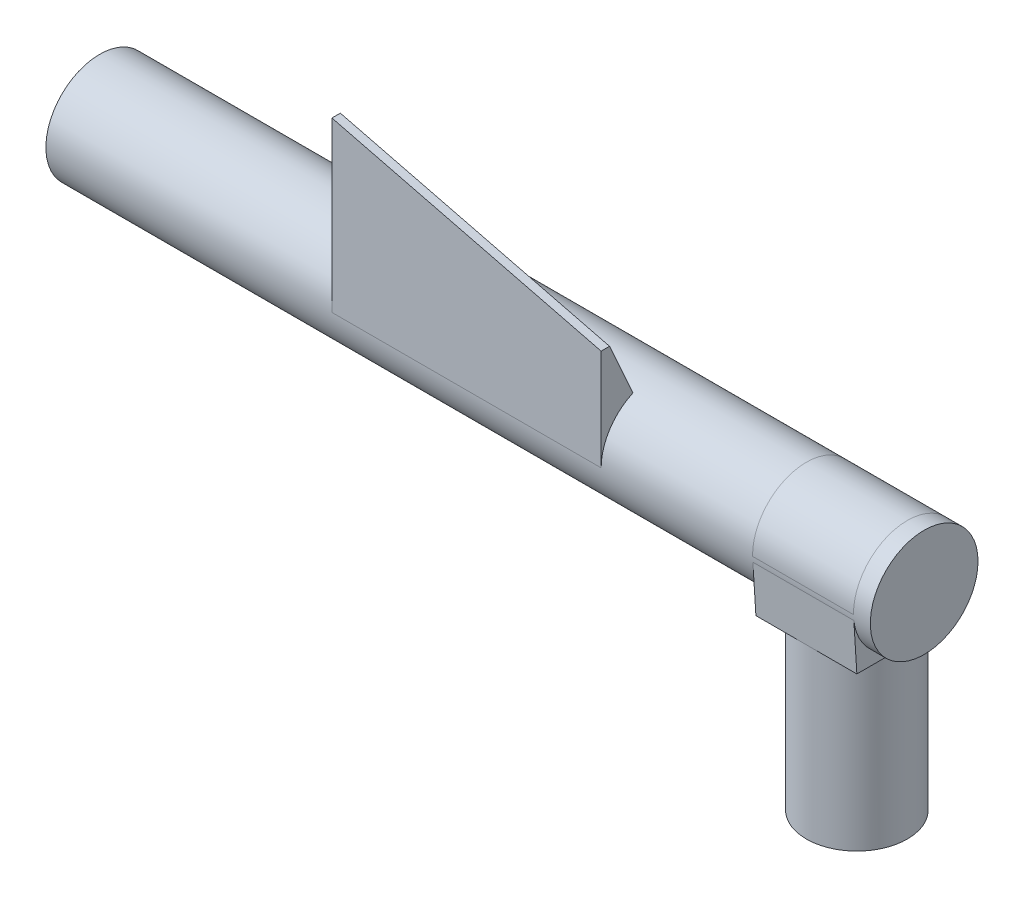
ISO-10303-21;
HEADER;
FILE_DESCRIPTION(('STEP AP214'),'2;1');
FILE_NAME('part.step','',(''),(''),'','','');
FILE_SCHEMA(('AUTOMOTIVE_DESIGN { 1 0 10303 214 1 1 1 1 }'));
ENDSEC;
DATA;
#1=APPLICATION_CONTEXT('core data for automotive mechanical design processes');
#2=APPLICATION_PROTOCOL_DEFINITION('international standard','automotive_design',2000,#1);
#3=PRODUCT_CONTEXT('',#1,'mechanical');
#4=PRODUCT('Part','Part','',(#3));
#5=PRODUCT_RELATED_PRODUCT_CATEGORY('part','',(#4));
#6=PRODUCT_DEFINITION_FORMATION('','',#4);
#7=PRODUCT_DEFINITION_CONTEXT('part definition',#1,'design');
#8=PRODUCT_DEFINITION('design','',#6,#7);
#9=PRODUCT_DEFINITION_SHAPE('','',#8);
#10=(LENGTH_UNIT() NAMED_UNIT(*) SI_UNIT(.MILLI.,.METRE.));
#11=(NAMED_UNIT(*) PLANE_ANGLE_UNIT() SI_UNIT($,.RADIAN.));
#12=(NAMED_UNIT(*) SI_UNIT($,.STERADIAN.) SOLID_ANGLE_UNIT());
#13=UNCERTAINTY_MEASURE_WITH_UNIT(LENGTH_MEASURE(1.E-05),#10,'distance_accuracy_value','');
#14=(GEOMETRIC_REPRESENTATION_CONTEXT(3) GLOBAL_UNCERTAINTY_ASSIGNED_CONTEXT((#13)) GLOBAL_UNIT_ASSIGNED_CONTEXT((#10,
#11,#12)) REPRESENTATION_CONTEXT('',''));
#15=CARTESIAN_POINT('',(0.,0.,0.));
#16=DIRECTION('',(0.,0.,1.));
#17=DIRECTION('',(1.,0.,0.));
#18=AXIS2_PLACEMENT_3D('',#15,#16,#17);
#19=CARTESIAN_POINT('',(3.,13.2027075664737,0.));
#20=DIRECTION('',(-1.,0.,0.));
#21=DIRECTION('',(0.,0.,1.));
#22=AXIS2_PLACEMENT_3D('',#19,#20,#21);
#23=PLANE('',#22);
#24=DIRECTION('',(0.,0.998001477692199,-0.0631905888893838));
#25=VECTOR('',#24,1.);
#26=CARTESIAN_POINT('',(3.,10.,-3.));
#27=LINE('',#26,#25);
#28=CARTESIAN_POINT('',(3.,10.,-3.));
#29=VERTEX_POINT('',#28);
#30=CARTESIAN_POINT('',(3.,12.8427317220948,-3.1799936128242));
#31=VERTEX_POINT('',#30);
#32=EDGE_CURVE('E501',#29,#31,#27,.T.);
#33=ORIENTED_EDGE('',*,*,#32,.T.);
#34=CARTESIAN_POINT('',(3.,13.2,0.));
#35=DIRECTION('',(-1.,0.,0.));
#36=DIRECTION('',(0.,0.,1.));
#37=AXIS2_PLACEMENT_3D('',#34,#35,#36);
#38=CIRCLE('',#37,3.2);
#39=CARTESIAN_POINT('',(3.,10.,0.));
#40=VERTEX_POINT('',#39);
#41=EDGE_CURVE('E425',#31,#40,#38,.T.);
#42=ORIENTED_EDGE('',*,*,#41,.T.);
#43=DIRECTION('',(0.,0.,-1.));
#44=VECTOR('',#43,1.);
#45=CARTESIAN_POINT('',(3.,10.,3.));
#46=LINE('',#45,#44);
#47=EDGE_CURVE('E424',#40,#29,#46,.T.);
#48=ORIENTED_EDGE('',*,*,#47,.T.);
#49=EDGE_LOOP('',(#33,#42,#48));
#50=FACE_BOUND('',#49,.T.);
#51=ADVANCED_FACE('F127',(#50),#23,.F.);
#52=CARTESIAN_POINT('',(3.,10.,3.));
#53=VERTEX_POINT('',#52);
#54=EDGE_CURVE('E498',#53,#40,#46,.T.);
#55=ORIENTED_EDGE('',*,*,#54,.T.);
#56=CARTESIAN_POINT('',(3.,12.8427317220948,3.1799936128242));
#57=VERTEX_POINT('',#56);
#58=EDGE_CURVE('E492',#40,#57,#38,.T.);
#59=ORIENTED_EDGE('',*,*,#58,.T.);
#60=DIRECTION('',(0.,-0.998001477692199,-0.063190588889384));
#61=VECTOR('',#60,1.);
#62=CARTESIAN_POINT('',(3.,10.,3.));
#63=LINE('',#62,#61);
#64=EDGE_CURVE('E504',#57,#53,#63,.T.);
#65=ORIENTED_EDGE('',*,*,#64,.T.);
#66=EDGE_LOOP('',(#55,#59,#65));
#67=FACE_BOUND('',#66,.T.);
#68=ADVANCED_FACE('F617',(#67),#23,.F.);
#69=CARTESIAN_POINT('',(-3.,13.2027075664737,0.));
#70=DIRECTION('',(-1.,0.,0.));
#71=DIRECTION('',(0.,0.,1.));
#72=AXIS2_PLACEMENT_3D('',#69,#70,#71);
#73=PLANE('',#72);
#74=CARTESIAN_POINT('',(-3.,13.2,0.));
#75=DIRECTION('',(-1.,0.,0.));
#76=DIRECTION('',(0.,0.,1.));
#77=AXIS2_PLACEMENT_3D('',#74,#75,#76);
#78=CIRCLE('',#77,3.2);
#79=CARTESIAN_POINT('',(-3.,12.8427317220948,-3.1799936128242));
#80=VERTEX_POINT('',#79);
#81=CARTESIAN_POINT('',(-3.,10.,0.));
#82=VERTEX_POINT('',#81);
#83=EDGE_CURVE('E488',#80,#82,#78,.T.);
#84=ORIENTED_EDGE('',*,*,#83,.F.);
#85=DIRECTION('',(0.,0.998001477692199,-0.0631905888893838));
#86=VECTOR('',#85,1.);
#87=CARTESIAN_POINT('',(-3.,10.,-3.));
#88=LINE('',#87,#86);
#89=CARTESIAN_POINT('',(-3.,10.,-3.));
#90=VERTEX_POINT('',#89);
#91=EDGE_CURVE('E514',#90,#80,#88,.T.);
#92=ORIENTED_EDGE('',*,*,#91,.F.);
#93=DIRECTION('',(0.,0.,-1.));
#94=VECTOR('',#93,1.);
#95=CARTESIAN_POINT('',(-3.,10.,3.));
#96=LINE('',#95,#94);
#97=EDGE_CURVE('E507',#82,#90,#96,.T.);
#98=ORIENTED_EDGE('',*,*,#97,.F.);
#99=EDGE_LOOP('',(#84,#92,#98));
#100=FACE_BOUND('',#99,.T.);
#101=ADVANCED_FACE('F623',(#100),#73,.T.);
#102=CARTESIAN_POINT('',(-3.,12.8427317220948,3.1799936128242));
#103=VERTEX_POINT('',#102);
#104=EDGE_CURVE('E418',#82,#103,#78,.T.);
#105=ORIENTED_EDGE('',*,*,#104,.F.);
#106=CARTESIAN_POINT('',(-3.,10.,3.));
#107=VERTEX_POINT('',#106);
#108=EDGE_CURVE('E510',#107,#82,#96,.T.);
#109=ORIENTED_EDGE('',*,*,#108,.F.);
#110=DIRECTION('',(0.,-0.998001477692199,-0.063190588889384));
#111=VECTOR('',#110,1.);
#112=CARTESIAN_POINT('',(-3.,10.,3.));
#113=LINE('',#112,#111);
#114=EDGE_CURVE('E517',#103,#107,#113,.T.);
#115=ORIENTED_EDGE('',*,*,#114,.F.);
#116=EDGE_LOOP('',(#105,#109,#115));
#117=FACE_BOUND('',#116,.T.);
#118=ADVANCED_FACE('F641',(#117),#73,.T.);
#119=CARTESIAN_POINT('',(0.,10.,0.));
#120=DIRECTION('',(0.,-1.,0.));
#121=DIRECTION('',(0.,0.,-1.));
#122=AXIS2_PLACEMENT_3D('',#119,#120,#121);
#123=CYLINDRICAL_SURFACE('',#122,3.);
#124=CARTESIAN_POINT('',(0.,10.,0.));
#125=DIRECTION('',(0.,1.,0.));
#126=DIRECTION('',(0.,0.,1.));
#127=AXIS2_PLACEMENT_3D('',#124,#125,#126);
#128=CIRCLE('',#127,3.);
#129=CARTESIAN_POINT('',(0.,10.,3.));
#130=VERTEX_POINT('',#129);
#131=EDGE_CURVE('E559',#130,#40,#128,.T.);
#132=ORIENTED_EDGE('',*,*,#131,.F.);
#133=EDGE_CURVE('E553',#82,#130,#128,.T.);
#134=ORIENTED_EDGE('',*,*,#133,.F.);
#135=CARTESIAN_POINT('',(0.,10.,-3.));
#136=VERTEX_POINT('',#135);
#137=EDGE_CURVE('E557',#136,#82,#128,.T.);
#138=ORIENTED_EDGE('',*,*,#137,.F.);
#139=EDGE_CURVE('E562',#40,#136,#128,.T.);
#140=ORIENTED_EDGE('',*,*,#139,.F.);
#141=EDGE_LOOP('',(#132,#134,#138,#140));
#142=FACE_BOUND('',#141,.T.);
#143=CARTESIAN_POINT('',(0.,0.,0.));
#144=DIRECTION('',(0.,1.,0.));
#145=DIRECTION('',(0.,0.,1.));
#146=AXIS2_PLACEMENT_3D('',#143,#144,#145);
#147=CIRCLE('',#146,3.);
#148=CARTESIAN_POINT('',(0.,0.,3.));
#149=VERTEX_POINT('',#148);
#150=EDGE_CURVE('E549',#149,#149,#147,.T.);
#151=ORIENTED_EDGE('',*,*,#150,.T.);
#152=EDGE_LOOP('',(#151));
#153=FACE_BOUND('',#152,.T.);
#154=ADVANCED_FACE('F129',(#142,#153),#123,.T.);
#155=CARTESIAN_POINT('',(0.,0.,0.));
#156=DIRECTION('',(0.,1.,0.));
#157=DIRECTION('',(0.,0.,1.));
#158=AXIS2_PLACEMENT_3D('',#155,#156,#157);
#159=PLANE('',#158);
#160=CARTESIAN_POINT('',(0.,0.,0.));
#161=DIRECTION('',(0.,1.,0.));
#162=DIRECTION('',(0.,0.,1.));
#163=AXIS2_PLACEMENT_3D('',#160,#161,#162);
#164=CIRCLE('',#163,1.1);
#165=CARTESIAN_POINT('',(0.,0.,1.1));
#166=VERTEX_POINT('',#165);
#167=EDGE_CURVE('E542',#166,#166,#164,.T.);
#168=ORIENTED_EDGE('',*,*,#167,.T.);
#169=EDGE_LOOP('',(#168));
#170=FACE_BOUND('',#169,.T.);
#171=ORIENTED_EDGE('',*,*,#150,.F.);
#172=EDGE_LOOP('',(#171));
#173=FACE_BOUND('',#172,.T.);
#174=ADVANCED_FACE('F656',(#170,#173),#159,.F.);
#175=CARTESIAN_POINT('',(0.,14.,0.));
#176=DIRECTION('',(0.,-1.,0.));
#177=DIRECTION('',(0.,0.,-1.));
#178=AXIS2_PLACEMENT_3D('',#175,#176,#177);
#179=CYLINDRICAL_SURFACE('',#178,1.1);
#180=CARTESIAN_POINT('',(0.,10.,0.));
#181=DIRECTION('',(0.,1.,0.));
#182=DIRECTION('',(0.,0.,1.));
#183=AXIS2_PLACEMENT_3D('',#180,#181,#182);
#184=CIRCLE('',#183,1.1);
#185=CARTESIAN_POINT('',(0.,10.,1.1));
#186=VERTEX_POINT('',#185);
#187=EDGE_CURVE('E545',#186,#186,#184,.F.);
#188=ORIENTED_EDGE('',*,*,#187,.F.);
#189=EDGE_LOOP('',(#188));
#190=FACE_BOUND('',#189,.T.);
#191=ORIENTED_EDGE('',*,*,#167,.F.);
#192=EDGE_LOOP('',(#191));
#193=FACE_BOUND('',#192,.T.);
#194=ADVANCED_FACE('F654',(#190,#193),#179,.F.);
#195=CARTESIAN_POINT('',(-3.,10.,-3.));
#196=DIRECTION('',(0.,-0.0631905888893838,-0.998001477692199));
#197=DIRECTION('',(0.,0.998001477692199,-0.0631905888893838));
#198=AXIS2_PLACEMENT_3D('',#195,#196,#197);
#199=PLANE('',#198);
#200=DIRECTION('',(1.,0.,0.));
#201=VECTOR('',#200,1.);
#202=CARTESIAN_POINT('',(-45.,12.8427317220948,-3.1799936128242));
#203=LINE('',#202,#201);
#204=EDGE_CURVE('E420',#31,#80,#203,.F.);
#205=ORIENTED_EDGE('',*,*,#204,.F.);
#206=ORIENTED_EDGE('',*,*,#32,.F.);
#207=DIRECTION('',(1.,0.,0.));
#208=VECTOR('',#207,1.);
#209=CARTESIAN_POINT('',(-3.,10.,-3.));
#210=LINE('',#209,#208);
#211=EDGE_CURVE('E520',#136,#29,#210,.T.);
#212=ORIENTED_EDGE('',*,*,#211,.F.);
#213=EDGE_CURVE('E524',#90,#136,#210,.T.);
#214=ORIENTED_EDGE('',*,*,#213,.F.);
#215=ORIENTED_EDGE('',*,*,#91,.T.);
#216=EDGE_LOOP('',(#205,#206,#212,#214,#215));
#217=FACE_BOUND('',#216,.T.);
#218=ADVANCED_FACE('F593',(#217),#199,.T.);
#219=CARTESIAN_POINT('',(-3.,10.,3.));
#220=DIRECTION('',(0.,-0.0631905888893841,0.998001477692199));
#221=DIRECTION('',(0.,-0.998001477692199,-0.0631905888893841));
#222=AXIS2_PLACEMENT_3D('',#219,#220,#221);
#223=PLANE('',#222);
#224=DIRECTION('',(1.,0.,0.));
#225=VECTOR('',#224,1.);
#226=CARTESIAN_POINT('',(-45.,12.8427317220948,3.1799936128242));
#227=LINE('',#226,#225);
#228=EDGE_CURVE('E414',#103,#57,#227,.T.);
#229=ORIENTED_EDGE('',*,*,#228,.F.);
#230=ORIENTED_EDGE('',*,*,#114,.T.);
#231=DIRECTION('',(1.,0.,0.));
#232=VECTOR('',#231,1.);
#233=CARTESIAN_POINT('',(-3.,10.,3.));
#234=LINE('',#233,#232);
#235=EDGE_CURVE('E538',#107,#130,#234,.T.);
#236=ORIENTED_EDGE('',*,*,#235,.T.);
#237=EDGE_CURVE('E534',#130,#53,#234,.T.);
#238=ORIENTED_EDGE('',*,*,#237,.T.);
#239=ORIENTED_EDGE('',*,*,#64,.F.);
#240=EDGE_LOOP('',(#229,#230,#236,#238,#239));
#241=FACE_BOUND('',#240,.T.);
#242=ADVANCED_FACE('F592',(#241),#223,.T.);
#243=CARTESIAN_POINT('',(-3.,10.,3.));
#244=DIRECTION('',(0.,-1.,0.));
#245=DIRECTION('',(0.,0.,-1.));
#246=AXIS2_PLACEMENT_3D('',#243,#244,#245);
#247=PLANE('',#246);
#248=ORIENTED_EDGE('',*,*,#108,.T.);
#249=ORIENTED_EDGE('',*,*,#133,.T.);
#250=ORIENTED_EDGE('',*,*,#235,.F.);
#251=EDGE_LOOP('',(#248,#249,#250));
#252=FACE_BOUND('',#251,.T.);
#253=ADVANCED_FACE('F637',(#252),#247,.T.);
#254=ORIENTED_EDGE('',*,*,#213,.T.);
#255=ORIENTED_EDGE('',*,*,#137,.T.);
#256=ORIENTED_EDGE('',*,*,#97,.T.);
#257=EDGE_LOOP('',(#254,#255,#256));
#258=FACE_BOUND('',#257,.T.);
#259=ADVANCED_FACE('F644',(#258),#247,.T.);
#260=ORIENTED_EDGE('',*,*,#47,.F.);
#261=ORIENTED_EDGE('',*,*,#139,.T.);
#262=ORIENTED_EDGE('',*,*,#211,.T.);
#263=EDGE_LOOP('',(#260,#261,#262));
#264=FACE_BOUND('',#263,.T.);
#265=ADVANCED_FACE('F646',(#264),#247,.T.);
#266=ORIENTED_EDGE('',*,*,#237,.F.);
#267=ORIENTED_EDGE('',*,*,#131,.T.);
#268=ORIENTED_EDGE('',*,*,#54,.F.);
#269=EDGE_LOOP('',(#266,#267,#268));
#270=FACE_BOUND('',#269,.T.);
#271=ADVANCED_FACE('F651',(#270),#247,.T.);
#272=ORIENTED_EDGE('',*,*,#187,.T.);
#273=EDGE_LOOP('',(#272));
#274=FACE_BOUND('',#273,.T.);
#275=ADVANCED_FACE('F445',(#274),#247,.T.);
#276=CARTESIAN_POINT('',(-45.,13.2,0.));
#277=DIRECTION('',(1.,0.,0.));
#278=DIRECTION('',(0.,0.,-1.));
#279=AXIS2_PLACEMENT_3D('',#276,#277,#278);
#280=CYLINDRICAL_SURFACE('',#279,3.2);
#281=CARTESIAN_POINT('',(-28.,13.2171453063812,3.2000000000001));
#282=DIRECTION('',(1.,0.,0.));
#283=VECTOR('',#282,1.);
#284=LINE('',#281,#283);
#285=CARTESIAN_POINT('',(-28.,13.2085726531906,3.20000000000005));
#286=VERTEX_POINT('',#285);
#287=CARTESIAN_POINT('',(-12.,13.2085726531906,3.2000000000001));
#288=VERTEX_POINT('',#287);
#289=EDGE_CURVE('E13',#286,#288,#284,.T.);
#290=ORIENTED_EDGE('',*,*,#289,.F.);
#291=CARTESIAN_POINT('',(-28.,13.2,0.));
#292=DIRECTION('',(-1.,0.,0.));
#293=DIRECTION('',(0.,0.,1.));
#294=AXIS2_PLACEMENT_3D('',#291,#292,#293);
#295=CIRCLE('',#294,3.2);
#296=CARTESIAN_POINT('',(-28.,16.2899525345642,0.831972567970977));
#297=VERTEX_POINT('',#296);
#298=EDGE_CURVE('E138',#297,#286,#295,.F.);
#299=ORIENTED_EDGE('',*,*,#298,.F.);
#300=CARTESIAN_POINT('',(-12.,16.1210290183354,1.30674767037962));
#301=CARTESIAN_POINT('',(-12.5327172808159,16.1318175771161,1.28260960237118));
#302=CARTESIAN_POINT('',(-13.0655039547062,16.1417354998061,1.25965904558185));
#303=CARTESIAN_POINT('',(-14.1311865119216,16.1601062201779,1.21587409458485));
#304=CARTESIAN_POINT('',(-14.6640823945531,16.1685590268912,1.19503968733287));
#305=CARTESIAN_POINT('',(-15.7299465545352,16.1842755851027,1.15522840003174));
#306=CARTESIAN_POINT('',(-16.2629148296526,16.1915393673994,1.13625147187459));
#307=CARTESIAN_POINT('',(-17.3289203351974,16.2050806778421,1.09993904667608));
#308=CARTESIAN_POINT('',(-17.86195756573,16.2113582044668,1.08260355216655));
#309=CARTESIAN_POINT('',(-19.1952490413564,16.2260371490334,1.04105766598032));
#310=CARTESIAN_POINT('',(-19.9955372264799,16.2339262076875,1.01775610039493));
#311=CARTESIAN_POINT('',(-21.5962061918816,16.2482909569012,0.973885022583297));
#312=CARTESIAN_POINT('',(-22.3965869728142,16.2547666367698,0.95331553102312));
#313=CARTESIAN_POINT('',(-23.9974515273732,16.2666189942293,0.914474060138594));
#314=CARTESIAN_POINT('',(-24.7979353041368,16.2719956173939,0.896202194611786));
#315=CARTESIAN_POINT('',(-26.3989406212621,16.2818696420056,0.861620996003739));
#316=CARTESIAN_POINT('',(-27.1994621610112,16.2863670546786,0.845311637865852));
#317=CARTESIAN_POINT('',(-28.,16.2905350179435,0.829815222121917));
#318=B_SPLINE_CURVE_WITH_KNOTS('',3,(#300,#301,#302,#303,#304,#305,#306,#307,#308,#309,#310,
#311,#312,#313,#314,#315,#316,#317),.UNSPECIFIED.,.F.,.F.,(4,2,2,2,2,2,2,2,4),(0.,
1.6001139523159,3.2002180406591,4.80028067595219,6.40034577923093,8.8023366006626,
11.2043455903009,13.6064735005721,16.0085707380085),.UNSPECIFIED.);
#319=CARTESIAN_POINT('',(-12.,16.1195853906671,1.30995573186466));
#320=VERTEX_POINT('',#319);
#321=EDGE_CURVE('E145',#320,#297,#318,.T.);
#322=ORIENTED_EDGE('',*,*,#321,.F.);
#323=CARTESIAN_POINT('',(-12.,13.2,0.));
#324=DIRECTION('',(-1.,0.,0.));
#325=DIRECTION('',(0.,0.,1.));
#326=AXIS2_PLACEMENT_3D('',#323,#324,#325);
#327=CIRCLE('',#326,3.2);
#328=EDGE_CURVE('E149',#320,#288,#327,.F.);
#329=ORIENTED_EDGE('',*,*,#328,.T.);
#330=EDGE_LOOP('',(#290,#299,#322,#329));
#331=FACE_BOUND('',#330,.T.);
#332=CARTESIAN_POINT('',(-3.00000000000002,13.2,0.));
#333=DIRECTION('',(-1.,0.,0.));
#334=DIRECTION('',(0.,-0.0145853287427229,0.999893628435279));
#335=AXIS2_PLACEMENT_3D('',#332,#333,#334);
#336=CIRCLE('',#335,3.2);
#337=CARTESIAN_POINT('',(-3.,13.1533269480233,3.19965961099289));
#338=VERTEX_POINT('',#337);
#339=CARTESIAN_POINT('',(-3.00000000000005,13.1533269480239,-3.1996596109929));
#340=VERTEX_POINT('',#339);
#341=EDGE_CURVE('E413',#338,#340,#336,.T.);
#342=ORIENTED_EDGE('',*,*,#341,.T.);
#343=DIRECTION('',(1.,0.,0.));
#344=VECTOR('',#343,1.);
#345=CARTESIAN_POINT('',(-3.,13.1533269480233,-3.19965961099289));
#346=LINE('',#345,#344);
#347=CARTESIAN_POINT('',(3.00000000000005,13.1533269480239,-3.1996596109929));
#348=VERTEX_POINT('',#347);
#349=EDGE_CURVE('E528',#340,#348,#346,.T.);
#350=ORIENTED_EDGE('',*,*,#349,.T.);
#351=CARTESIAN_POINT('',(3.,13.2027075664737,0.));
#352=DIRECTION('',(-1.,0.,0.));
#353=DIRECTION('',(0.,-0.0154312473084755,0.999880931214564));
#354=AXIS2_PLACEMENT_3D('',#351,#352,#353);
#355=CIRCLE('',#354,3.20004063594476);
#356=CARTESIAN_POINT('',(3.,13.1533269480233,3.19965961099289));
#357=VERTEX_POINT('',#356);
#358=EDGE_CURVE('E419',#357,#348,#355,.T.);
#359=ORIENTED_EDGE('',*,*,#358,.F.);
#360=DIRECTION('',(1.,0.,0.));
#361=VECTOR('',#360,1.);
#362=CARTESIAN_POINT('',(-3.,13.1533269480233,3.19965961099289));
#363=LINE('',#362,#361);
#364=EDGE_CURVE('E530',#338,#357,#363,.T.);
#365=ORIENTED_EDGE('',*,*,#364,.F.);
#366=EDGE_LOOP('',(#342,#350,#359,#365));
#367=FACE_BOUND('',#366,.T.);
#368=ORIENTED_EDGE('',*,*,#41,.F.);
#369=ORIENTED_EDGE('',*,*,#204,.T.);
#370=ORIENTED_EDGE('',*,*,#83,.T.);
#371=ORIENTED_EDGE('',*,*,#104,.T.);
#372=ORIENTED_EDGE('',*,*,#228,.T.);
#373=ORIENTED_EDGE('',*,*,#58,.F.);
#374=EDGE_LOOP('',(#368,#369,#370,#371,#372,#373));
#375=FACE_BOUND('',#374,.T.);
#376=CARTESIAN_POINT('',(-45.,13.2,0.));
#377=DIRECTION('',(1.,0.,0.));
#378=DIRECTION('',(0.,0.,-1.));
#379=AXIS2_PLACEMENT_3D('',#376,#377,#378);
#380=CIRCLE('',#379,3.2);
#381=CARTESIAN_POINT('',(-45.,13.2,-3.2));
#382=VERTEX_POINT('',#381);
#383=EDGE_CURVE('E409',#382,#382,#380,.T.);
#384=ORIENTED_EDGE('',*,*,#383,.T.);
#385=EDGE_LOOP('',(#384));
#386=FACE_BOUND('',#385,.T.);
#387=CARTESIAN_POINT('',(4.,13.2,0.));
#388=DIRECTION('',(1.,0.,0.));
#389=DIRECTION('',(0.,0.,-1.));
#390=AXIS2_PLACEMENT_3D('',#387,#388,#389);
#391=CIRCLE('',#390,3.2);
#392=CARTESIAN_POINT('',(4.,13.2,-3.2));
#393=VERTEX_POINT('',#392);
#394=EDGE_CURVE('E337',#393,#393,#391,.T.);
#395=ORIENTED_EDGE('',*,*,#394,.F.);
#396=EDGE_LOOP('',(#395));
#397=FACE_BOUND('',#396,.T.);
#398=ADVANCED_FACE('F435',(#331,#367,#375,#386,#397),#280,.T.);
#399=CARTESIAN_POINT('',(-45.,13.2,0.));
#400=DIRECTION('',(1.,0.,0.));
#401=DIRECTION('',(0.,0.,-1.));
#402=AXIS2_PLACEMENT_3D('',#399,#400,#401);
#403=PLANE('',#402);
#404=ORIENTED_EDGE('',*,*,#383,.F.);
#405=EDGE_LOOP('',(#404));
#406=FACE_BOUND('',#405,.T.);
#407=ADVANCED_FACE('F444',(#406),#403,.F.);
#408=CARTESIAN_POINT('',(4.,13.2,0.));
#409=DIRECTION('',(1.,0.,0.));
#410=DIRECTION('',(0.,0.,-1.));
#411=AXIS2_PLACEMENT_3D('',#408,#409,#410);
#412=PLANE('',#411);
#413=ORIENTED_EDGE('',*,*,#394,.T.);
#414=EDGE_LOOP('',(#413));
#415=FACE_BOUND('',#414,.T.);
#416=ADVANCED_FACE('F382',(#415),#412,.T.);
#417=CARTESIAN_POINT('',(-3.,13.2027075664737,0.));
#418=DIRECTION('',(1.,0.,0.));
#419=DIRECTION('',(0.,0.,-1.));
#420=AXIS2_PLACEMENT_3D('',#417,#418,#419);
#421=CYLINDRICAL_SURFACE('',#420,3.20004063594476);
#422=ORIENTED_EDGE('',*,*,#364,.T.);
#423=ORIENTED_EDGE('',*,*,#358,.T.);
#424=ORIENTED_EDGE('',*,*,#349,.F.);
#425=ORIENTED_EDGE('',*,*,#341,.F.);
#426=EDGE_LOOP('',(#422,#423,#424,#425));
#427=FACE_BOUND('',#426,.T.);
#428=ADVANCED_FACE('F582',(#427),#421,.T.);
#429=CARTESIAN_POINT('',(-28.,0.,-1.82145964977565E-13));
#430=DIRECTION('',(-1.,0.,0.));
#431=DIRECTION('',(0.,0.,1.));
#432=AXIS2_PLACEMENT_3D('',#429,#430,#431);
#433=PLANE('',#432);
#434=DIRECTION('',(0.,-0.965429082558387,-0.260665852290765));
#435=VECTOR('',#434,1.);
#436=CARTESIAN_POINT('',(-28.,23.2,2.7000000000001));
#437=LINE('',#436,#435);
#438=CARTESIAN_POINT('',(-28.,23.2171453063812,2.7000000000001));
#439=VERTEX_POINT('',#438);
#440=EDGE_CURVE('E252',#439,#297,#437,.T.);
#441=ORIENTED_EDGE('',*,*,#440,.T.);
#442=ORIENTED_EDGE('',*,*,#298,.T.);
#443=DIRECTION('',(0.,1.,0.));
#444=VECTOR('',#443,1.);
#445=CARTESIAN_POINT('',(-28.,13.2,3.2000000000001));
#446=LINE('',#445,#444);
#447=CARTESIAN_POINT('',(-28.,23.2171453063812,3.2000000000001));
#448=VERTEX_POINT('',#447);
#449=EDGE_CURVE('E131',#286,#448,#446,.T.);
#450=ORIENTED_EDGE('',*,*,#449,.T.);
#451=DIRECTION('',(0.,0.,-1.));
#452=VECTOR('',#451,1.);
#453=CARTESIAN_POINT('',(-28.,23.2,3.2000000000001));
#454=LINE('',#453,#452);
#455=EDGE_CURVE('E245',#448,#439,#454,.T.);
#456=ORIENTED_EDGE('',*,*,#455,.T.);
#457=EDGE_LOOP('',(#441,#442,#450,#456));
#458=FACE_BOUND('',#457,.T.);
#459=ADVANCED_FACE('F290',(#458),#433,.T.);
#460=CARTESIAN_POINT('',(-12.,0.,0.));
#461=DIRECTION('',(-1.,0.,0.));
#462=DIRECTION('',(0.,0.,1.));
#463=AXIS2_PLACEMENT_3D('',#460,#461,#462);
#464=PLANE('',#463);
#465=ORIENTED_EDGE('',*,*,#328,.F.);
#466=DIRECTION('',(0.,-0.911921505175105,-0.410364677328801));
#467=VECTOR('',#466,1.);
#468=CARTESIAN_POINT('',(-12.,19.2,2.70000000000023));
#469=LINE('',#468,#467);
#470=CARTESIAN_POINT('',(-12.,19.2171453063812,2.70000000000023));
#471=VERTEX_POINT('',#470);
#472=EDGE_CURVE('E224',#471,#320,#469,.T.);
#473=ORIENTED_EDGE('',*,*,#472,.F.);
#474=DIRECTION('',(0.,0.,-1.));
#475=VECTOR('',#474,1.);
#476=CARTESIAN_POINT('',(-12.,19.2,3.20000000000023));
#477=LINE('',#476,#475);
#478=CARTESIAN_POINT('',(-12.,19.2171453063812,3.20000000000023));
#479=VERTEX_POINT('',#478);
#480=EDGE_CURVE('E217',#479,#471,#477,.T.);
#481=ORIENTED_EDGE('',*,*,#480,.F.);
#482=DIRECTION('',(0.,1.,0.));
#483=VECTOR('',#482,1.);
#484=CARTESIAN_POINT('',(-12.,13.2,3.20000000000021));
#485=LINE('',#484,#483);
#486=EDGE_CURVE('E221',#288,#479,#485,.T.);
#487=ORIENTED_EDGE('',*,*,#486,.F.);
#488=EDGE_LOOP('',(#465,#473,#481,#487));
#489=FACE_BOUND('',#488,.T.);
#490=ADVANCED_FACE('F220',(#489),#464,.F.);
#491=CARTESIAN_POINT('',(-12.,19.2171453063812,2.70000000000023));
#492=CARTESIAN_POINT('',(-17.3333333333333,20.5504786397145,2.70000000000019));
#493=CARTESIAN_POINT('',(-22.6666666666667,21.8838119730478,2.70000000000014));
#494=CARTESIAN_POINT('',(-28.,23.2171453063812,2.7000000000001));
#495=CARTESIAN_POINT('',(-12.,18.7171453063812,2.47500000000023));
#496=CARTESIAN_POINT('',(-17.3333333333333,19.9393675286034,2.47500000000018));
#497=CARTESIAN_POINT('',(-22.6666666666667,21.1615897508256,2.47500000000014));
#498=CARTESIAN_POINT('',(-28.,22.3838119730478,2.4750000000001));
#499=CARTESIAN_POINT('',(-12.,17.7171453063812,2.02500000000023));
#500=CARTESIAN_POINT('',(-17.3333333333333,18.7171453063812,2.02500000000018));
#501=CARTESIAN_POINT('',(-22.6666666666667,19.7171453063812,2.02500000000014));
#502=CARTESIAN_POINT('',(-28.,20.7171453063812,2.0250000000001));
#503=CARTESIAN_POINT('',(-12.,16.2171453063812,1.35000000000022));
#504=CARTESIAN_POINT('',(-17.3333333333333,16.8838119730478,1.35000000000018));
#505=CARTESIAN_POINT('',(-22.6666666666667,17.5504786397145,1.35000000000014));
#506=CARTESIAN_POINT('',(-28.,18.2171453063811,1.3500000000001));
#507=CARTESIAN_POINT('',(-12.,14.7171453063812,0.675000000000214));
#508=CARTESIAN_POINT('',(-17.3333333333333,15.0504786397145,0.675000000000173));
#509=CARTESIAN_POINT('',(-22.6666666666667,15.3838119730478,0.675000000000135));
#510=CARTESIAN_POINT('',(-28.,15.7171453063812,0.675000000000095));
#511=CARTESIAN_POINT('',(-12.,13.7171453063812,0.225000000000211));
#512=CARTESIAN_POINT('',(-17.3333333333333,13.8282564174923,0.225000000000171));
#513=CARTESIAN_POINT('',(-22.6666666666667,13.9393675286034,0.225000000000135));
#514=CARTESIAN_POINT('',(-28.,14.0504786397145,0.225000000000097));
#515=CARTESIAN_POINT('',(-12.,13.2171453063812,2.086215185926E-13));
#516=CARTESIAN_POINT('',(-17.3333333333333,13.2171453063812,1.7007800837129E-13));
#517=CARTESIAN_POINT('',(-22.6666666666667,13.2171453063812,1.3457026423294E-13));
#518=CARTESIAN_POINT('',(-28.,13.2171453063812,0.));
#519=B_SPLINE_SURFACE_WITH_KNOTS('',3,3,((#491,#492,#493,#494),(#495,#496,#497,#498),(#499,#500,
#501,#502),(#503,#504,#505,#506),(#507,#508,#509,#510),(#511,#512,#513,#514),(#515,#516,#517,
#518)),.UNSPECIFIED.,.F.,.F.,.F.,(4,1,1,1,4),(4,4),(0.417859238239157,0.522197245352975,
0.626535252466793,0.730873259580611,0.835211266694429),(0.,1.),.UNSPECIFIED.);
#520=CARTESIAN_POINT('',(-12.,19.2171453063812,2.70000000000023));
#521=CARTESIAN_POINT('',(-17.3333333333333,20.5504786397145,2.70000000000019));
#522=CARTESIAN_POINT('',(-22.6666666666667,21.8838119730478,2.70000000000014));
#523=CARTESIAN_POINT('',(-28.,23.2171453063812,2.7000000000001));
#524=B_SPLINE_CURVE_WITH_KNOTS('',3,(#520,#521,#522,#523),.UNSPECIFIED.,.F.,.F.,(4,4),(0.,1.),.UNSPECIFIED.);
#525=EDGE_CURVE('E249',#471,#439,#524,.T.);
#526=ORIENTED_EDGE('',*,*,#472,.T.);
#527=ORIENTED_EDGE('',*,*,#321,.T.);
#528=ORIENTED_EDGE('',*,*,#440,.F.);
#529=ORIENTED_EDGE('',*,*,#525,.F.);
#530=EDGE_LOOP('',(#526,#527,#528,#529));
#531=FACE_BOUND('',#530,.T.);
#532=ADVANCED_FACE('F277',(#531),#519,.T.);
#533=CARTESIAN_POINT('',(-12.,19.2171453063812,3.20000000000023));
#534=DIRECTION('',(0.242535625036333,0.970142500145332,0.));
#535=DIRECTION('',(0.,0.,-1.));
#536=AXIS2_PLACEMENT_3D('',#533,#534,#535);
#537=PLANE('',#536);
#538=ORIENTED_EDGE('',*,*,#480,.T.);
#539=ORIENTED_EDGE('',*,*,#525,.T.);
#540=ORIENTED_EDGE('',*,*,#455,.F.);
#541=CARTESIAN_POINT('',(-12.,19.2171453063812,3.20000000000023));
#542=CARTESIAN_POINT('',(-17.3333333333333,20.5504786397145,3.20000000000019));
#543=CARTESIAN_POINT('',(-22.6666666666667,21.8838119730478,3.20000000000014));
#544=CARTESIAN_POINT('',(-28.,23.2171453063812,3.2000000000001));
#545=B_SPLINE_CURVE_WITH_KNOTS('',3,(#541,#542,#543,#544),.UNSPECIFIED.,.F.,.F.,(4,4),(0.,1.),.UNSPECIFIED.);
#546=EDGE_CURVE('E231',#479,#448,#545,.T.);
#547=ORIENTED_EDGE('',*,*,#546,.F.);
#548=EDGE_LOOP('',(#538,#539,#540,#547));
#549=FACE_BOUND('',#548,.T.);
#550=ADVANCED_FACE('F244',(#549),#537,.T.);
#551=CARTESIAN_POINT('',(-12.,13.2171453063812,3.20000000000021));
#552=DIRECTION('',(0.,0.,1.));
#553=DIRECTION('',(0.,1.,0.));
#554=AXIS2_PLACEMENT_3D('',#551,#552,#553);
#555=PLANE('',#554);
#556=ORIENTED_EDGE('',*,*,#486,.T.);
#557=ORIENTED_EDGE('',*,*,#546,.T.);
#558=ORIENTED_EDGE('',*,*,#449,.F.);
#559=ORIENTED_EDGE('',*,*,#289,.T.);
#560=EDGE_LOOP('',(#556,#557,#558,#559));
#561=FACE_BOUND('',#560,.T.);
#562=ADVANCED_FACE('F237',(#561),#555,.T.);
#563=CLOSED_SHELL('',(#51,#68,#101,#118,#154,#174,#194,#218,#242,#253,#259,#265,#271,#275,#398,
#407,#416,#428,#459,#490,#532,#550,#562));
#564=MANIFOLD_SOLID_BREP('B2',#563);
#565=ADVANCED_BREP_SHAPE_REPRESENTATION('',(#18,#564),#14);
#566=SHAPE_DEFINITION_REPRESENTATION(#9,#565);
ENDSEC;
END-ISO-10303-21;
